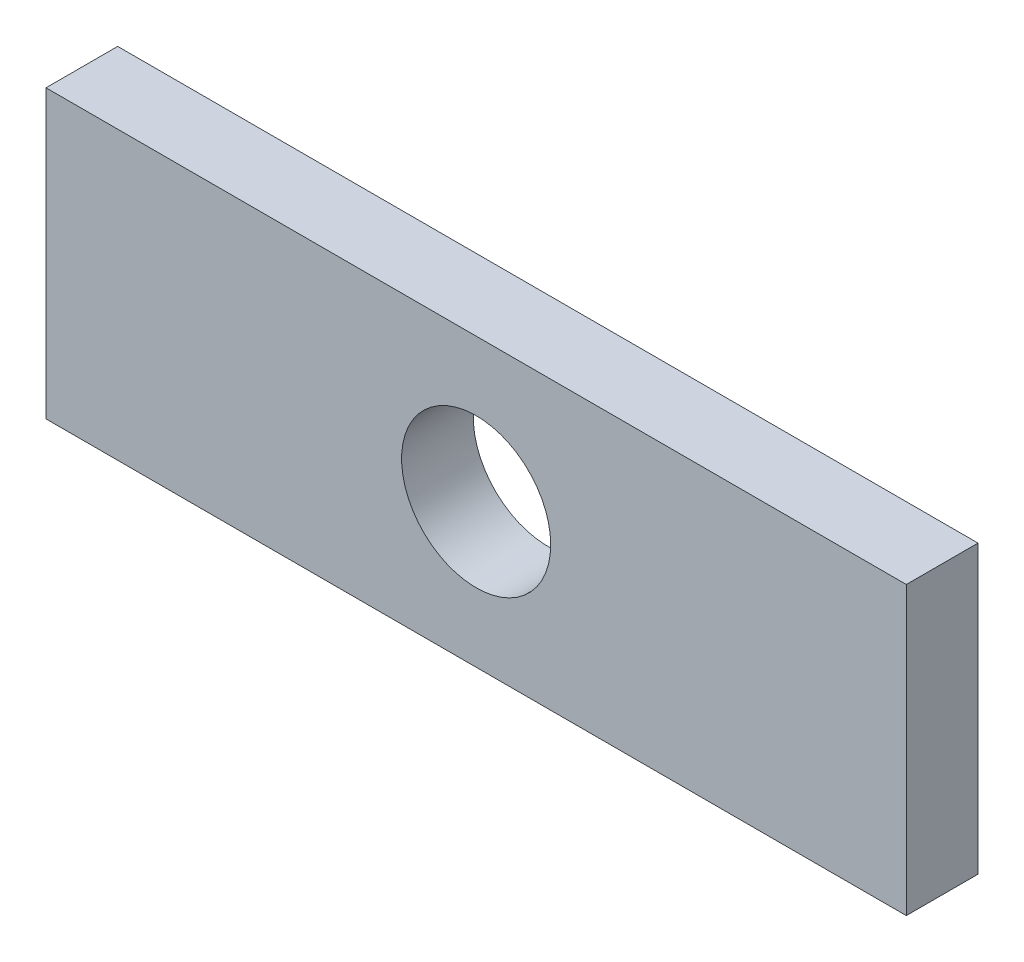
ISO-10303-21;
HEADER;
FILE_DESCRIPTION(('STEP AP214'),'2;1');
FILE_NAME('part.step','',(''),(''),'','','');
FILE_SCHEMA(('AUTOMOTIVE_DESIGN { 1 0 10303 214 1 1 1 1 }'));
ENDSEC;
DATA;
#1=APPLICATION_CONTEXT('core data for automotive mechanical design processes');
#2=APPLICATION_PROTOCOL_DEFINITION('international standard','automotive_design',2000,#1);
#3=PRODUCT_CONTEXT('',#1,'mechanical');
#4=PRODUCT('Part','Part','',(#3));
#5=PRODUCT_RELATED_PRODUCT_CATEGORY('part','',(#4));
#6=PRODUCT_DEFINITION_FORMATION('','',#4);
#7=PRODUCT_DEFINITION_CONTEXT('part definition',#1,'design');
#8=PRODUCT_DEFINITION('design','',#6,#7);
#9=PRODUCT_DEFINITION_SHAPE('','',#8);
#10=(LENGTH_UNIT() NAMED_UNIT(*) SI_UNIT(.MILLI.,.METRE.));
#11=(NAMED_UNIT(*) PLANE_ANGLE_UNIT() SI_UNIT($,.RADIAN.));
#12=(NAMED_UNIT(*) SI_UNIT($,.STERADIAN.) SOLID_ANGLE_UNIT());
#13=UNCERTAINTY_MEASURE_WITH_UNIT(LENGTH_MEASURE(1.E-05),#10,'distance_accuracy_value','');
#14=(GEOMETRIC_REPRESENTATION_CONTEXT(3) GLOBAL_UNCERTAINTY_ASSIGNED_CONTEXT((#13)) GLOBAL_UNIT_ASSIGNED_CONTEXT((#10,
#11,#12)) REPRESENTATION_CONTEXT('',''));
#15=CARTESIAN_POINT('',(0.,0.,0.));
#16=DIRECTION('',(0.,0.,1.));
#17=DIRECTION('',(1.,0.,0.));
#18=AXIS2_PLACEMENT_3D('',#15,#16,#17);
#19=CARTESIAN_POINT('',(-19.05,-6.35,3.175));
#20=DIRECTION('',(0.,0.,1.));
#21=DIRECTION('',(1.,0.,0.));
#22=AXIS2_PLACEMENT_3D('',#19,#20,#21);
#23=PLANE('',#22);
#24=DIRECTION('',(0.,-1.,0.));
#25=VECTOR('',#24,1.);
#26=CARTESIAN_POINT('',(-19.05,6.35,3.175));
#27=LINE('',#26,#25);
#28=CARTESIAN_POINT('',(-19.05,6.35,3.175));
#29=VERTEX_POINT('',#28);
#30=CARTESIAN_POINT('',(-19.05,-6.35,3.175));
#31=VERTEX_POINT('',#30);
#32=EDGE_CURVE('E84',#29,#31,#27,.T.);
#33=ORIENTED_EDGE('',*,*,#32,.T.);
#34=DIRECTION('',(1.,0.,0.));
#35=VECTOR('',#34,1.);
#36=CARTESIAN_POINT('',(-19.05,-6.35,3.175));
#37=LINE('',#36,#35);
#38=CARTESIAN_POINT('',(19.05,-6.35,3.175));
#39=VERTEX_POINT('',#38);
#40=EDGE_CURVE('E79',#31,#39,#37,.T.);
#41=ORIENTED_EDGE('',*,*,#40,.T.);
#42=DIRECTION('',(0.,1.,0.));
#43=VECTOR('',#42,1.);
#44=CARTESIAN_POINT('',(19.05,6.35,3.175));
#45=LINE('',#44,#43);
#46=CARTESIAN_POINT('',(19.05,6.35,3.175));
#47=VERTEX_POINT('',#46);
#48=EDGE_CURVE('E82',#39,#47,#45,.T.);
#49=ORIENTED_EDGE('',*,*,#48,.T.);
#50=DIRECTION('',(-1.,0.,0.));
#51=VECTOR('',#50,1.);
#52=CARTESIAN_POINT('',(-19.05,6.35,3.175));
#53=LINE('',#52,#51);
#54=EDGE_CURVE('E49',#47,#29,#53,.T.);
#55=ORIENTED_EDGE('',*,*,#54,.T.);
#56=EDGE_LOOP('',(#33,#41,#49,#55));
#57=FACE_BOUND('',#56,.T.);
#58=CARTESIAN_POINT('',(0.,0.,3.175));
#59=DIRECTION('',(0.,0.,1.));
#60=DIRECTION('',(1.,0.,0.));
#61=AXIS2_PLACEMENT_3D('',#58,#59,#60);
#62=CIRCLE('',#61,3.302);
#63=CARTESIAN_POINT('',(3.302,0.,3.175));
#64=VERTEX_POINT('',#63);
#65=EDGE_CURVE('E99',#64,#64,#62,.T.);
#66=ORIENTED_EDGE('',*,*,#65,.F.);
#67=EDGE_LOOP('',(#66));
#68=FACE_BOUND('',#67,.T.);
#69=ADVANCED_FACE('F32',(#57,#68),#23,.T.);
#70=CARTESIAN_POINT('',(-19.05,-6.35,0.));
#71=DIRECTION('',(0.,0.,1.));
#72=DIRECTION('',(1.,0.,0.));
#73=AXIS2_PLACEMENT_3D('',#70,#71,#72);
#74=PLANE('',#73);
#75=DIRECTION('',(0.,-1.,0.));
#76=VECTOR('',#75,1.);
#77=CARTESIAN_POINT('',(-19.05,6.35,0.));
#78=LINE('',#77,#76);
#79=CARTESIAN_POINT('',(-19.05,6.35,0.));
#80=VERTEX_POINT('',#79);
#81=CARTESIAN_POINT('',(-19.05,-6.35,0.));
#82=VERTEX_POINT('',#81);
#83=EDGE_CURVE('E96',#80,#82,#78,.T.);
#84=ORIENTED_EDGE('',*,*,#83,.F.);
#85=DIRECTION('',(-1.,0.,0.));
#86=VECTOR('',#85,1.);
#87=CARTESIAN_POINT('',(-19.05,6.35,0.));
#88=LINE('',#87,#86);
#89=CARTESIAN_POINT('',(19.05,6.35,0.));
#90=VERTEX_POINT('',#89);
#91=EDGE_CURVE('E72',#90,#80,#88,.T.);
#92=ORIENTED_EDGE('',*,*,#91,.F.);
#93=DIRECTION('',(0.,1.,0.));
#94=VECTOR('',#93,1.);
#95=CARTESIAN_POINT('',(19.05,6.35,0.));
#96=LINE('',#95,#94);
#97=CARTESIAN_POINT('',(19.05,-6.35,0.));
#98=VERTEX_POINT('',#97);
#99=EDGE_CURVE('E66',#98,#90,#96,.T.);
#100=ORIENTED_EDGE('',*,*,#99,.F.);
#101=DIRECTION('',(1.,0.,0.));
#102=VECTOR('',#101,1.);
#103=CARTESIAN_POINT('',(-19.05,-6.35,0.));
#104=LINE('',#103,#102);
#105=EDGE_CURVE('E88',#82,#98,#104,.T.);
#106=ORIENTED_EDGE('',*,*,#105,.F.);
#107=EDGE_LOOP('',(#84,#92,#100,#106));
#108=FACE_BOUND('',#107,.T.);
#109=CARTESIAN_POINT('',(0.,0.,0.));
#110=DIRECTION('',(0.,0.,1.));
#111=DIRECTION('',(1.,0.,0.));
#112=AXIS2_PLACEMENT_3D('',#109,#110,#111);
#113=CIRCLE('',#112,3.302);
#114=CARTESIAN_POINT('',(3.302,0.,0.));
#115=VERTEX_POINT('',#114);
#116=EDGE_CURVE('E111',#115,#115,#113,.T.);
#117=ORIENTED_EDGE('',*,*,#116,.T.);
#118=EDGE_LOOP('',(#117));
#119=FACE_BOUND('',#118,.T.);
#120=ADVANCED_FACE('F107',(#108,#119),#74,.F.);
#121=CARTESIAN_POINT('',(-19.05,6.35,3.175));
#122=DIRECTION('',(1.,0.,0.));
#123=DIRECTION('',(0.,0.,-1.));
#124=AXIS2_PLACEMENT_3D('',#121,#122,#123);
#125=PLANE('',#124);
#126=ORIENTED_EDGE('',*,*,#83,.T.);
#127=DIRECTION('',(0.,0.,-1.));
#128=VECTOR('',#127,1.);
#129=CARTESIAN_POINT('',(-19.05,-6.35,3.175));
#130=LINE('',#129,#128);
#131=EDGE_CURVE('E11',#31,#82,#130,.T.);
#132=ORIENTED_EDGE('',*,*,#131,.F.);
#133=ORIENTED_EDGE('',*,*,#32,.F.);
#134=DIRECTION('',(0.,0.,-1.));
#135=VECTOR('',#134,1.);
#136=CARTESIAN_POINT('',(-19.05,6.35,3.175));
#137=LINE('',#136,#135);
#138=EDGE_CURVE('E92',#29,#80,#137,.T.);
#139=ORIENTED_EDGE('',*,*,#138,.T.);
#140=EDGE_LOOP('',(#126,#132,#133,#139));
#141=FACE_BOUND('',#140,.T.);
#142=ADVANCED_FACE('F34',(#141),#125,.F.);
#143=CARTESIAN_POINT('',(-19.05,-6.35,3.175));
#144=DIRECTION('',(0.,1.,0.));
#145=DIRECTION('',(0.,0.,1.));
#146=AXIS2_PLACEMENT_3D('',#143,#144,#145);
#147=PLANE('',#146);
#148=ORIENTED_EDGE('',*,*,#105,.T.);
#149=DIRECTION('',(0.,0.,-1.));
#150=VECTOR('',#149,1.);
#151=CARTESIAN_POINT('',(19.05,-6.35,3.175));
#152=LINE('',#151,#150);
#153=EDGE_CURVE('E41',#39,#98,#152,.T.);
#154=ORIENTED_EDGE('',*,*,#153,.F.);
#155=ORIENTED_EDGE('',*,*,#40,.F.);
#156=ORIENTED_EDGE('',*,*,#131,.T.);
#157=EDGE_LOOP('',(#148,#154,#155,#156));
#158=FACE_BOUND('',#157,.T.);
#159=ADVANCED_FACE('F87',(#158),#147,.F.);
#160=CARTESIAN_POINT('',(19.05,6.35,3.175));
#161=DIRECTION('',(-1.,0.,0.));
#162=DIRECTION('',(0.,-1.,0.));
#163=AXIS2_PLACEMENT_3D('',#160,#161,#162);
#164=PLANE('',#163);
#165=ORIENTED_EDGE('',*,*,#99,.T.);
#166=DIRECTION('',(0.,0.,-1.));
#167=VECTOR('',#166,1.);
#168=CARTESIAN_POINT('',(19.05,6.35,3.175));
#169=LINE('',#168,#167);
#170=EDGE_CURVE('E89',#47,#90,#169,.T.);
#171=ORIENTED_EDGE('',*,*,#170,.F.);
#172=ORIENTED_EDGE('',*,*,#48,.F.);
#173=ORIENTED_EDGE('',*,*,#153,.T.);
#174=EDGE_LOOP('',(#165,#171,#172,#173));
#175=FACE_BOUND('',#174,.T.);
#176=ADVANCED_FACE('F90',(#175),#164,.F.);
#177=CARTESIAN_POINT('',(-19.05,6.35,3.175));
#178=DIRECTION('',(0.,-1.,0.));
#179=DIRECTION('',(1.,0.,0.));
#180=AXIS2_PLACEMENT_3D('',#177,#178,#179);
#181=PLANE('',#180);
#182=ORIENTED_EDGE('',*,*,#91,.T.);
#183=ORIENTED_EDGE('',*,*,#138,.F.);
#184=ORIENTED_EDGE('',*,*,#54,.F.);
#185=ORIENTED_EDGE('',*,*,#170,.T.);
#186=EDGE_LOOP('',(#182,#183,#184,#185));
#187=FACE_BOUND('',#186,.T.);
#188=ADVANCED_FACE('F104',(#187),#181,.F.);
#189=CARTESIAN_POINT('',(0.,0.,3.175));
#190=DIRECTION('',(0.,0.,-1.));
#191=DIRECTION('',(-1.,0.,0.));
#192=AXIS2_PLACEMENT_3D('',#189,#190,#191);
#193=CYLINDRICAL_SURFACE('',#192,3.302);
#194=ORIENTED_EDGE('',*,*,#65,.T.);
#195=EDGE_LOOP('',(#194));
#196=FACE_BOUND('',#195,.T.);
#197=ORIENTED_EDGE('',*,*,#116,.F.);
#198=EDGE_LOOP('',(#197));
#199=FACE_BOUND('',#198,.T.);
#200=ADVANCED_FACE('F117',(#196,#199),#193,.F.);
#201=CLOSED_SHELL('',(#69,#120,#142,#159,#176,#188,#200));
#202=MANIFOLD_SOLID_BREP('B2',#201);
#203=ADVANCED_BREP_SHAPE_REPRESENTATION('',(#18,#202),#14);
#204=SHAPE_DEFINITION_REPRESENTATION(#9,#203);
ENDSEC;
END-ISO-10303-21;
